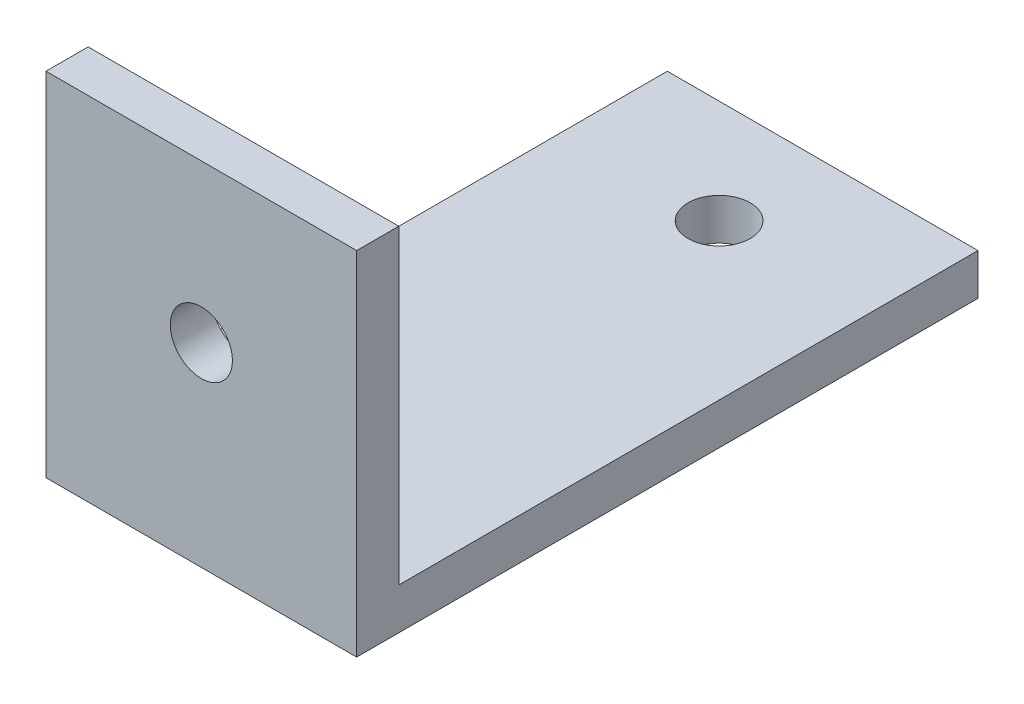
ISO-10303-21;
HEADER;
FILE_DESCRIPTION(('STEP AP214'),'2;1');
FILE_NAME('part.step','',(''),(''),'','','');
FILE_SCHEMA(('AUTOMOTIVE_DESIGN { 1 0 10303 214 1 1 1 1 }'));
ENDSEC;
DATA;
#1=APPLICATION_CONTEXT('core data for automotive mechanical design processes');
#2=APPLICATION_PROTOCOL_DEFINITION('international standard','automotive_design',2000,#1);
#3=PRODUCT_CONTEXT('',#1,'mechanical');
#4=PRODUCT('Part','Part','',(#3));
#5=PRODUCT_RELATED_PRODUCT_CATEGORY('part','',(#4));
#6=PRODUCT_DEFINITION_FORMATION('','',#4);
#7=PRODUCT_DEFINITION_CONTEXT('part definition',#1,'design');
#8=PRODUCT_DEFINITION('design','',#6,#7);
#9=PRODUCT_DEFINITION_SHAPE('','',#8);
#10=(LENGTH_UNIT() NAMED_UNIT(*) SI_UNIT(.MILLI.,.METRE.));
#11=(NAMED_UNIT(*) PLANE_ANGLE_UNIT() SI_UNIT($,.RADIAN.));
#12=(NAMED_UNIT(*) SI_UNIT($,.STERADIAN.) SOLID_ANGLE_UNIT());
#13=UNCERTAINTY_MEASURE_WITH_UNIT(LENGTH_MEASURE(1.E-05),#10,'distance_accuracy_value','');
#14=(GEOMETRIC_REPRESENTATION_CONTEXT(3) GLOBAL_UNCERTAINTY_ASSIGNED_CONTEXT((#13)) GLOBAL_UNIT_ASSIGNED_CONTEXT((#10,
#11,#12)) REPRESENTATION_CONTEXT('',''));
#15=CARTESIAN_POINT('',(0.,0.,0.));
#16=DIRECTION('',(0.,0.,1.));
#17=DIRECTION('',(1.,0.,0.));
#18=AXIS2_PLACEMENT_3D('',#15,#16,#17);
#19=CARTESIAN_POINT('',(0.,2.,0.));
#20=DIRECTION('',(0.,1.,0.));
#21=DIRECTION('',(0.,0.,1.));
#22=AXIS2_PLACEMENT_3D('',#19,#20,#21);
#23=PLANE('',#22);
#24=DIRECTION('',(-1.,0.,0.));
#25=VECTOR('',#24,1.);
#26=CARTESIAN_POINT('',(-29.237545238713,2.,6.08151870103003));
#27=LINE('',#26,#25);
#28=CARTESIAN_POINT('',(-14.237545238713,2.,6.08151870103003));
#29=VERTEX_POINT('',#28);
#30=CARTESIAN_POINT('',(-29.237545238713,2.,6.08151870103003));
#31=VERTEX_POINT('',#30);
#32=EDGE_CURVE('E52',#29,#31,#27,.T.);
#33=ORIENTED_EDGE('',*,*,#32,.F.);
#34=DIRECTION('',(0.,0.,-1.));
#35=VECTOR('',#34,1.);
#36=CARTESIAN_POINT('',(-14.237545238713,2.,8.11633571639048));
#37=LINE('',#36,#35);
#38=CARTESIAN_POINT('',(-14.237545238713,2.,-21.8836642836095));
#39=VERTEX_POINT('',#38);
#40=EDGE_CURVE('E90',#29,#39,#37,.T.);
#41=ORIENTED_EDGE('',*,*,#40,.T.);
#42=DIRECTION('',(-1.,0.,0.));
#43=VECTOR('',#42,1.);
#44=CARTESIAN_POINT('',(-14.237545238713,2.,-21.8836642836095));
#45=LINE('',#44,#43);
#46=CARTESIAN_POINT('',(-29.237545238713,2.,-21.8836642836095));
#47=VERTEX_POINT('',#46);
#48=EDGE_CURVE('E58',#39,#47,#45,.T.);
#49=ORIENTED_EDGE('',*,*,#48,.T.);
#50=DIRECTION('',(0.,0.,1.));
#51=VECTOR('',#50,1.);
#52=CARTESIAN_POINT('',(-29.237545238713,2.,8.11633571639049));
#53=LINE('',#52,#51);
#54=EDGE_CURVE('E101',#47,#31,#53,.T.);
#55=ORIENTED_EDGE('',*,*,#54,.T.);
#56=EDGE_LOOP('',(#33,#41,#49,#55));
#57=FACE_BOUND('',#56,.T.);
#58=CARTESIAN_POINT('',(-21.737545238713,2.,-16.8836642836095));
#59=DIRECTION('',(0.,1.,0.));
#60=DIRECTION('',(0.,0.,1.));
#61=AXIS2_PLACEMENT_3D('',#58,#59,#60);
#62=CIRCLE('',#61,1.5);
#63=CARTESIAN_POINT('',(-21.737545238713,2.,-15.3836642836095));
#64=VERTEX_POINT('',#63);
#65=EDGE_CURVE('E106',#64,#64,#62,.T.);
#66=ORIENTED_EDGE('',*,*,#65,.F.);
#67=EDGE_LOOP('',(#66));
#68=FACE_BOUND('',#67,.T.);
#69=CARTESIAN_POINT('',(-21.737545238713,2.,3.11633571639049));
#70=DIRECTION('',(0.,1.,0.));
#71=DIRECTION('',(0.,0.,1.));
#72=AXIS2_PLACEMENT_3D('',#69,#70,#71);
#73=CIRCLE('',#72,1.5);
#74=CARTESIAN_POINT('',(-21.737545238713,2.,4.61633571639049));
#75=VERTEX_POINT('',#74);
#76=EDGE_CURVE('E138',#75,#75,#73,.T.);
#77=ORIENTED_EDGE('',*,*,#76,.F.);
#78=EDGE_LOOP('',(#77));
#79=FACE_BOUND('',#78,.T.);
#80=ADVANCED_FACE('F37',(#57,#68,#79),#23,.T.);
#81=CARTESIAN_POINT('',(0.,0.,0.));
#82=DIRECTION('',(0.,1.,0.));
#83=DIRECTION('',(0.,0.,1.));
#84=AXIS2_PLACEMENT_3D('',#81,#82,#83);
#85=PLANE('',#84);
#86=DIRECTION('',(0.,0.,-1.));
#87=VECTOR('',#86,1.);
#88=CARTESIAN_POINT('',(-14.237545238713,0.,8.11633571639048));
#89=LINE('',#88,#87);
#90=CARTESIAN_POINT('',(-14.237545238713,0.,8.11633571639048));
#91=VERTEX_POINT('',#90);
#92=CARTESIAN_POINT('',(-14.237545238713,0.,-21.8836642836095));
#93=VERTEX_POINT('',#92);
#94=EDGE_CURVE('E97',#91,#93,#89,.T.);
#95=ORIENTED_EDGE('',*,*,#94,.F.);
#96=DIRECTION('',(1.,0.,0.));
#97=VECTOR('',#96,1.);
#98=CARTESIAN_POINT('',(-14.237545238713,0.,8.11633571639048));
#99=LINE('',#98,#97);
#100=CARTESIAN_POINT('',(-29.237545238713,0.,8.11633571639049));
#101=VERTEX_POINT('',#100);
#102=EDGE_CURVE('E78',#101,#91,#99,.T.);
#103=ORIENTED_EDGE('',*,*,#102,.F.);
#104=DIRECTION('',(0.,0.,1.));
#105=VECTOR('',#104,1.);
#106=CARTESIAN_POINT('',(-29.237545238713,0.,8.11633571639049));
#107=LINE('',#106,#105);
#108=CARTESIAN_POINT('',(-29.237545238713,0.,-21.8836642836095));
#109=VERTEX_POINT('',#108);
#110=EDGE_CURVE('E91',#109,#101,#107,.T.);
#111=ORIENTED_EDGE('',*,*,#110,.F.);
#112=DIRECTION('',(-1.,0.,0.));
#113=VECTOR('',#112,1.);
#114=CARTESIAN_POINT('',(-14.237545238713,0.,-21.8836642836095));
#115=LINE('',#114,#113);
#116=EDGE_CURVE('E105',#93,#109,#115,.T.);
#117=ORIENTED_EDGE('',*,*,#116,.F.);
#118=EDGE_LOOP('',(#95,#103,#111,#117));
#119=FACE_BOUND('',#118,.T.);
#120=CARTESIAN_POINT('',(-21.737545238713,0.,-16.8836642836095));
#121=DIRECTION('',(0.,1.,0.));
#122=DIRECTION('',(0.,0.,1.));
#123=AXIS2_PLACEMENT_3D('',#120,#121,#122);
#124=CIRCLE('',#123,1.5);
#125=CARTESIAN_POINT('',(-21.737545238713,0.,-15.3836642836095));
#126=VERTEX_POINT('',#125);
#127=EDGE_CURVE('E110',#126,#126,#124,.T.);
#128=ORIENTED_EDGE('',*,*,#127,.T.);
#129=EDGE_LOOP('',(#128));
#130=FACE_BOUND('',#129,.T.);
#131=CARTESIAN_POINT('',(-21.737545238713,0.,3.11633571639049));
#132=DIRECTION('',(0.,1.,0.));
#133=DIRECTION('',(0.,0.,1.));
#134=AXIS2_PLACEMENT_3D('',#131,#132,#133);
#135=CIRCLE('',#134,1.5);
#136=CARTESIAN_POINT('',(-21.737545238713,0.,4.61633571639049));
#137=VERTEX_POINT('',#136);
#138=EDGE_CURVE('E134',#137,#137,#135,.T.);
#139=ORIENTED_EDGE('',*,*,#138,.T.);
#140=EDGE_LOOP('',(#139));
#141=FACE_BOUND('',#140,.T.);
#142=ADVANCED_FACE('F103',(#119,#130,#141),#85,.F.);
#143=CARTESIAN_POINT('',(-14.237545238713,2.,8.11633571639048));
#144=DIRECTION('',(-1.,0.,0.));
#145=DIRECTION('',(0.,0.,1.));
#146=AXIS2_PLACEMENT_3D('',#143,#144,#145);
#147=PLANE('',#146);
#148=ORIENTED_EDGE('',*,*,#94,.T.);
#149=DIRECTION('',(0.,-1.,0.));
#150=VECTOR('',#149,1.);
#151=CARTESIAN_POINT('',(-14.237545238713,2.,-21.8836642836095));
#152=LINE('',#151,#150);
#153=EDGE_CURVE('E11',#39,#93,#152,.T.);
#154=ORIENTED_EDGE('',*,*,#153,.F.);
#155=ORIENTED_EDGE('',*,*,#40,.F.);
#156=DIRECTION('',(0.,-1.,0.));
#157=VECTOR('',#156,1.);
#158=CARTESIAN_POINT('',(-14.237545238713,17.,6.08151870103003));
#159=LINE('',#158,#157);
#160=CARTESIAN_POINT('',(-14.237545238713,17.,6.08151870103003));
#161=VERTEX_POINT('',#160);
#162=EDGE_CURVE('E125',#161,#29,#159,.T.);
#163=ORIENTED_EDGE('',*,*,#162,.F.);
#164=DIRECTION('',(0.,0.,-1.));
#165=VECTOR('',#164,1.);
#166=CARTESIAN_POINT('',(-14.237545238713,17.,6.08151870103003));
#167=LINE('',#166,#165);
#168=CARTESIAN_POINT('',(-14.237545238713,17.,8.11633571639048));
#169=VERTEX_POINT('',#168);
#170=EDGE_CURVE('E100',#169,#161,#167,.T.);
#171=ORIENTED_EDGE('',*,*,#170,.F.);
#172=DIRECTION('',(0.,-1.,0.));
#173=VECTOR('',#172,1.);
#174=CARTESIAN_POINT('',(-14.237545238713,2.,8.11633571639048));
#175=LINE('',#174,#173);
#176=EDGE_CURVE('E83',#169,#91,#175,.T.);
#177=ORIENTED_EDGE('',*,*,#176,.T.);
#178=EDGE_LOOP('',(#148,#154,#155,#163,#171,#177));
#179=FACE_BOUND('',#178,.T.);
#180=ADVANCED_FACE('F39',(#179),#147,.F.);
#181=CARTESIAN_POINT('',(-14.237545238713,2.,-21.8836642836095));
#182=DIRECTION('',(0.,0.,1.));
#183=DIRECTION('',(1.,0.,0.));
#184=AXIS2_PLACEMENT_3D('',#181,#182,#183);
#185=PLANE('',#184);
#186=ORIENTED_EDGE('',*,*,#116,.T.);
#187=DIRECTION('',(0.,-1.,0.));
#188=VECTOR('',#187,1.);
#189=CARTESIAN_POINT('',(-29.237545238713,2.,-21.8836642836095));
#190=LINE('',#189,#188);
#191=EDGE_CURVE('E45',#47,#109,#190,.T.);
#192=ORIENTED_EDGE('',*,*,#191,.F.);
#193=ORIENTED_EDGE('',*,*,#48,.F.);
#194=ORIENTED_EDGE('',*,*,#153,.T.);
#195=EDGE_LOOP('',(#186,#192,#193,#194));
#196=FACE_BOUND('',#195,.T.);
#197=ADVANCED_FACE('F122',(#196),#185,.F.);
#198=CARTESIAN_POINT('',(-29.237545238713,2.,8.11633571639049));
#199=DIRECTION('',(1.,0.,0.));
#200=DIRECTION('',(0.,0.,-1.));
#201=AXIS2_PLACEMENT_3D('',#198,#199,#200);
#202=PLANE('',#201);
#203=ORIENTED_EDGE('',*,*,#110,.T.);
#204=DIRECTION('',(0.,-1.,0.));
#205=VECTOR('',#204,1.);
#206=CARTESIAN_POINT('',(-29.237545238713,2.,8.11633571639049));
#207=LINE('',#206,#205);
#208=CARTESIAN_POINT('',(-29.237545238713,17.,8.11633571639048));
#209=VERTEX_POINT('',#208);
#210=EDGE_CURVE('E86',#209,#101,#207,.T.);
#211=ORIENTED_EDGE('',*,*,#210,.F.);
#212=DIRECTION('',(0.,0.,1.));
#213=VECTOR('',#212,1.);
#214=CARTESIAN_POINT('',(-29.237545238713,17.,6.08151870103003));
#215=LINE('',#214,#213);
#216=CARTESIAN_POINT('',(-29.237545238713,17.,6.08151870103003));
#217=VERTEX_POINT('',#216);
#218=EDGE_CURVE('E158',#217,#209,#215,.T.);
#219=ORIENTED_EDGE('',*,*,#218,.F.);
#220=DIRECTION('',(0.,-1.,0.));
#221=VECTOR('',#220,1.);
#222=CARTESIAN_POINT('',(-29.237545238713,17.,6.08151870103003));
#223=LINE('',#222,#221);
#224=EDGE_CURVE('E135',#217,#31,#223,.T.);
#225=ORIENTED_EDGE('',*,*,#224,.T.);
#226=ORIENTED_EDGE('',*,*,#54,.F.);
#227=ORIENTED_EDGE('',*,*,#191,.T.);
#228=EDGE_LOOP('',(#203,#211,#219,#225,#226,#227));
#229=FACE_BOUND('',#228,.T.);
#230=ADVANCED_FACE('F119',(#229),#202,.F.);
#231=CARTESIAN_POINT('',(-14.237545238713,2.,8.11633571639048));
#232=DIRECTION('',(0.,0.,-1.));
#233=DIRECTION('',(-1.,0.,0.));
#234=AXIS2_PLACEMENT_3D('',#231,#232,#233);
#235=PLANE('',#234);
#236=CARTESIAN_POINT('',(-21.737545238713,9.39816207176136,8.11633571639049));
#237=DIRECTION('',(0.,0.,-1.));
#238=DIRECTION('',(-1.,0.,0.));
#239=AXIS2_PLACEMENT_3D('',#236,#237,#238);
#240=CIRCLE('',#239,1.5);
#241=CARTESIAN_POINT('',(-23.237545238713,9.39816207176136,8.11633571639049));
#242=VERTEX_POINT('',#241);
#243=EDGE_CURVE('E161',#242,#242,#240,.T.);
#244=ORIENTED_EDGE('',*,*,#243,.T.);
#245=EDGE_LOOP('',(#244));
#246=FACE_BOUND('',#245,.T.);
#247=ORIENTED_EDGE('',*,*,#102,.T.);
#248=ORIENTED_EDGE('',*,*,#176,.F.);
#249=DIRECTION('',(1.,0.,0.));
#250=VECTOR('',#249,1.);
#251=CARTESIAN_POINT('',(-29.237545238713,17.,8.11633571639048));
#252=LINE('',#251,#250);
#253=EDGE_CURVE('E155',#209,#169,#252,.T.);
#254=ORIENTED_EDGE('',*,*,#253,.F.);
#255=ORIENTED_EDGE('',*,*,#210,.T.);
#256=EDGE_LOOP('',(#247,#248,#254,#255));
#257=FACE_BOUND('',#256,.T.);
#258=ADVANCED_FACE('F80',(#246,#257),#235,.F.);
#259=CARTESIAN_POINT('',(-21.737545238713,2.,-16.8836642836095));
#260=DIRECTION('',(0.,-1.,0.));
#261=DIRECTION('',(0.,0.,-1.));
#262=AXIS2_PLACEMENT_3D('',#259,#260,#261);
#263=CYLINDRICAL_SURFACE('',#262,1.5);
#264=ORIENTED_EDGE('',*,*,#65,.T.);
#265=EDGE_LOOP('',(#264));
#266=FACE_BOUND('',#265,.T.);
#267=ORIENTED_EDGE('',*,*,#127,.F.);
#268=EDGE_LOOP('',(#267));
#269=FACE_BOUND('',#268,.T.);
#270=ADVANCED_FACE('F182',(#266,#269),#263,.F.);
#271=CARTESIAN_POINT('',(-21.737545238713,2.,3.11633571639049));
#272=DIRECTION('',(0.,-1.,0.));
#273=DIRECTION('',(0.,0.,-1.));
#274=AXIS2_PLACEMENT_3D('',#271,#272,#273);
#275=CYLINDRICAL_SURFACE('',#274,1.5);
#276=ORIENTED_EDGE('',*,*,#76,.T.);
#277=EDGE_LOOP('',(#276));
#278=FACE_BOUND('',#277,.T.);
#279=ORIENTED_EDGE('',*,*,#138,.F.);
#280=EDGE_LOOP('',(#279));
#281=FACE_BOUND('',#280,.T.);
#282=ADVANCED_FACE('F175',(#278,#281),#275,.F.);
#283=CARTESIAN_POINT('',(-29.237545238713,17.,6.08151870103003));
#284=DIRECTION('',(0.,0.,1.));
#285=DIRECTION('',(1.,0.,0.));
#286=AXIS2_PLACEMENT_3D('',#283,#284,#285);
#287=PLANE('',#286);
#288=CARTESIAN_POINT('',(-21.737545238713,9.39816207176136,6.08151870103003));
#289=DIRECTION('',(0.,0.,-1.));
#290=DIRECTION('',(-1.,0.,0.));
#291=AXIS2_PLACEMENT_3D('',#288,#289,#290);
#292=CIRCLE('',#291,1.5);
#293=CARTESIAN_POINT('',(-23.237545238713,9.39816207176136,6.08151870103003));
#294=VERTEX_POINT('',#293);
#295=EDGE_CURVE('E163',#294,#294,#292,.T.);
#296=ORIENTED_EDGE('',*,*,#295,.F.);
#297=EDGE_LOOP('',(#296));
#298=FACE_BOUND('',#297,.T.);
#299=ORIENTED_EDGE('',*,*,#32,.T.);
#300=ORIENTED_EDGE('',*,*,#224,.F.);
#301=DIRECTION('',(-1.,0.,0.));
#302=VECTOR('',#301,1.);
#303=CARTESIAN_POINT('',(-29.237545238713,17.,6.08151870103003));
#304=LINE('',#303,#302);
#305=EDGE_CURVE('E133',#161,#217,#304,.T.);
#306=ORIENTED_EDGE('',*,*,#305,.F.);
#307=ORIENTED_EDGE('',*,*,#162,.T.);
#308=EDGE_LOOP('',(#299,#300,#306,#307));
#309=FACE_BOUND('',#308,.T.);
#310=ADVANCED_FACE('F129',(#298,#309),#287,.F.);
#311=CARTESIAN_POINT('',(0.,17.,0.));
#312=DIRECTION('',(0.,1.,0.));
#313=DIRECTION('',(0.,0.,1.));
#314=AXIS2_PLACEMENT_3D('',#311,#312,#313);
#315=PLANE('',#314);
#316=ORIENTED_EDGE('',*,*,#218,.T.);
#317=ORIENTED_EDGE('',*,*,#253,.T.);
#318=ORIENTED_EDGE('',*,*,#170,.T.);
#319=ORIENTED_EDGE('',*,*,#305,.T.);
#320=EDGE_LOOP('',(#316,#317,#318,#319));
#321=FACE_BOUND('',#320,.T.);
#322=ADVANCED_FACE('F154',(#321),#315,.T.);
#323=CARTESIAN_POINT('',(-21.737545238713,9.39816207176136,21.08151870103));
#324=DIRECTION('',(0.,0.,-1.));
#325=DIRECTION('',(-1.,0.,0.));
#326=AXIS2_PLACEMENT_3D('',#323,#324,#325);
#327=CYLINDRICAL_SURFACE('',#326,1.5);
#328=ORIENTED_EDGE('',*,*,#295,.T.);
#329=EDGE_LOOP('',(#328));
#330=FACE_BOUND('',#329,.T.);
#331=ORIENTED_EDGE('',*,*,#243,.F.);
#332=EDGE_LOOP('',(#331));
#333=FACE_BOUND('',#332,.T.);
#334=ADVANCED_FACE('F171',(#330,#333),#327,.F.);
#335=CLOSED_SHELL('',(#80,#142,#180,#197,#230,#258,#270,#282,#310,#322,#334));
#336=MANIFOLD_SOLID_BREP('B2',#335);
#337=ADVANCED_BREP_SHAPE_REPRESENTATION('',(#18,#336),#14);
#338=SHAPE_DEFINITION_REPRESENTATION(#9,#337);
ENDSEC;
END-ISO-10303-21;
